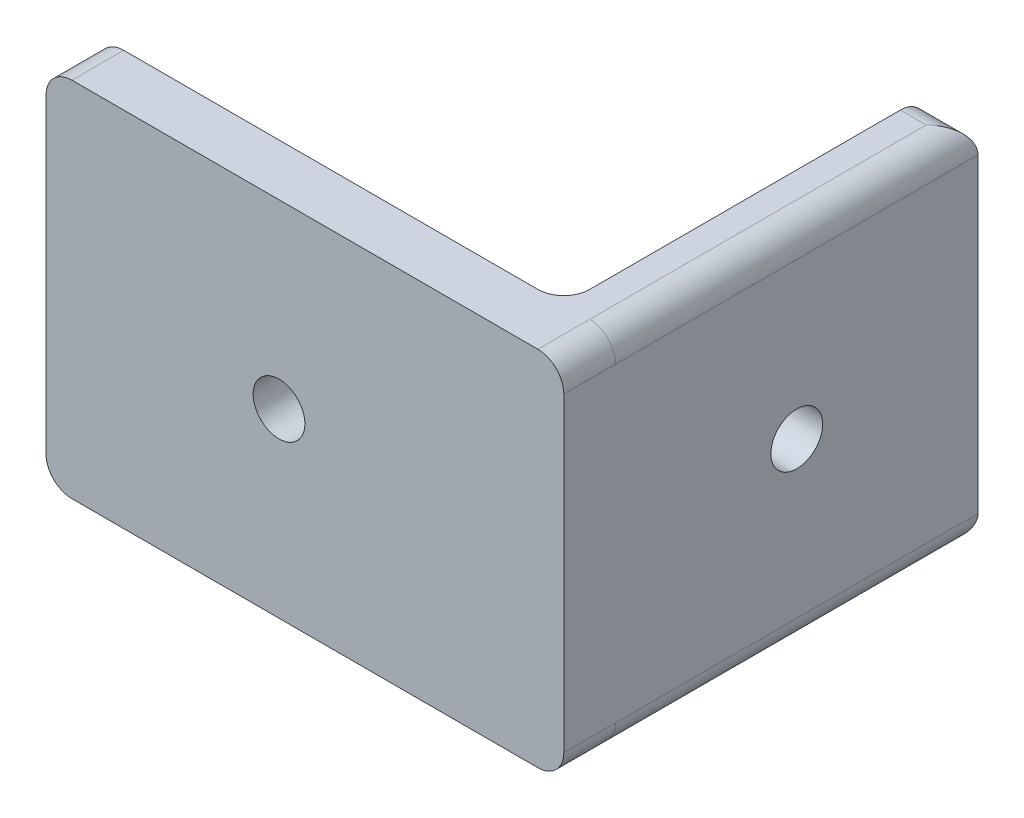
ISO-10303-21;
HEADER;
FILE_DESCRIPTION(('STEP AP214'),'2;1');
FILE_NAME('part.step','',(''),(''),'','','');
FILE_SCHEMA(('AUTOMOTIVE_DESIGN { 1 0 10303 214 1 1 1 1 }'));
ENDSEC;
DATA;
#1=APPLICATION_CONTEXT('core data for automotive mechanical design processes');
#2=APPLICATION_PROTOCOL_DEFINITION('international standard','automotive_design',2000,#1);
#3=PRODUCT_CONTEXT('',#1,'mechanical');
#4=PRODUCT('Part','Part','',(#3));
#5=PRODUCT_RELATED_PRODUCT_CATEGORY('part','',(#4));
#6=PRODUCT_DEFINITION_FORMATION('','',#4);
#7=PRODUCT_DEFINITION_CONTEXT('part definition',#1,'design');
#8=PRODUCT_DEFINITION('design','',#6,#7);
#9=PRODUCT_DEFINITION_SHAPE('','',#8);
#10=(LENGTH_UNIT() NAMED_UNIT(*) SI_UNIT(.MILLI.,.METRE.));
#11=(NAMED_UNIT(*) PLANE_ANGLE_UNIT() SI_UNIT($,.RADIAN.));
#12=(NAMED_UNIT(*) SI_UNIT($,.STERADIAN.) SOLID_ANGLE_UNIT());
#13=UNCERTAINTY_MEASURE_WITH_UNIT(LENGTH_MEASURE(1.E-05),#10,'distance_accuracy_value','');
#14=(GEOMETRIC_REPRESENTATION_CONTEXT(3) GLOBAL_UNCERTAINTY_ASSIGNED_CONTEXT((#13)) GLOBAL_UNIT_ASSIGNED_CONTEXT((#10,
#11,#12)) REPRESENTATION_CONTEXT('',''));
#15=CARTESIAN_POINT('',(0.,0.,0.));
#16=DIRECTION('',(0.,0.,1.));
#17=DIRECTION('',(1.,0.,0.));
#18=AXIS2_PLACEMENT_3D('',#15,#16,#17);
#19=CARTESIAN_POINT('',(190.,10.,-20.));
#20=DIRECTION('',(0.,0.,1.));
#21=DIRECTION('',(1.,0.,0.));
#22=AXIS2_PLACEMENT_3D('',#19,#20,#21);
#23=PLANE('',#22);
#24=CARTESIAN_POINT('',(90.,70.,-20.));
#25=DIRECTION('',(0.,0.,-1.));
#26=DIRECTION('',(-1.,0.,0.));
#27=AXIS2_PLACEMENT_3D('',#24,#25,#26);
#28=CIRCLE('',#27,9.99999999999999);
#29=CARTESIAN_POINT('',(80.,70.,-20.));
#30=VERTEX_POINT('',#29);
#31=EDGE_CURVE('E180',#30,#30,#28,.T.);
#32=ORIENTED_EDGE('',*,*,#31,.F.);
#33=EDGE_LOOP('',(#32));
#34=FACE_BOUND('',#33,.T.);
#35=DIRECTION('',(-1.,0.,0.));
#36=VECTOR('',#35,1.);
#37=CARTESIAN_POINT('',(10.0000000000001,140.,-20.));
#38=LINE('',#37,#36);
#39=CARTESIAN_POINT('',(170.,140.,-20.));
#40=VERTEX_POINT('',#39);
#41=CARTESIAN_POINT('',(10.0000000000001,140.,-20.));
#42=VERTEX_POINT('',#41);
#43=EDGE_CURVE('E200',#40,#42,#38,.T.);
#44=ORIENTED_EDGE('',*,*,#43,.F.);
#45=DIRECTION('',(0.,1.,0.));
#46=VECTOR('',#45,1.);
#47=CARTESIAN_POINT('',(170.,0.,-20.));
#48=LINE('',#47,#46);
#49=CARTESIAN_POINT('',(170.,0.,-20.));
#50=VERTEX_POINT('',#49);
#51=EDGE_CURVE('E165',#40,#50,#48,.F.);
#52=ORIENTED_EDGE('',*,*,#51,.T.);
#53=DIRECTION('',(1.,0.,0.));
#54=VECTOR('',#53,1.);
#55=CARTESIAN_POINT('',(10.0000000000001,0.,-20.));
#56=LINE('',#55,#54);
#57=CARTESIAN_POINT('',(10.0000000000001,0.,-20.));
#58=VERTEX_POINT('',#57);
#59=EDGE_CURVE('E145',#58,#50,#56,.T.);
#60=ORIENTED_EDGE('',*,*,#59,.F.);
#61=CARTESIAN_POINT('',(10.,10.,-20.));
#62=DIRECTION('',(0.,0.,1.));
#63=DIRECTION('',(-1.,0.,0.));
#64=AXIS2_PLACEMENT_3D('',#61,#62,#63);
#65=CIRCLE('',#64,10.);
#66=CARTESIAN_POINT('',(0.,10.0000000000001,-20.));
#67=VERTEX_POINT('',#66);
#68=EDGE_CURVE('E208',#67,#58,#65,.T.);
#69=ORIENTED_EDGE('',*,*,#68,.F.);
#70=DIRECTION('',(0.,-1.,0.));
#71=VECTOR('',#70,1.);
#72=CARTESIAN_POINT('',(0.,10.0000000000001,-20.));
#73=LINE('',#72,#71);
#74=CARTESIAN_POINT('',(0.,130.,-20.));
#75=VERTEX_POINT('',#74);
#76=EDGE_CURVE('E205',#75,#67,#73,.T.);
#77=ORIENTED_EDGE('',*,*,#76,.F.);
#78=CARTESIAN_POINT('',(10.,130.,-20.));
#79=DIRECTION('',(0.,0.,1.));
#80=DIRECTION('',(-1.,0.,0.));
#81=AXIS2_PLACEMENT_3D('',#78,#79,#80);
#82=CIRCLE('',#81,10.);
#83=EDGE_CURVE('E202',#42,#75,#82,.T.);
#84=ORIENTED_EDGE('',*,*,#83,.F.);
#85=EDGE_LOOP('',(#44,#52,#60,#69,#77,#84));
#86=FACE_BOUND('',#85,.T.);
#87=ADVANCED_FACE('F33',(#34,#86),#23,.F.);
#88=CARTESIAN_POINT('',(190.,10.,-20.));
#89=DIRECTION('',(0.,0.,1.));
#90=DIRECTION('',(1.,0.,0.));
#91=AXIS2_PLACEMENT_3D('',#88,#89,#90);
#92=CYLINDRICAL_SURFACE('',#91,10.);
#93=CARTESIAN_POINT('',(190.,10.,0.));
#94=DIRECTION('',(0.,0.,1.));
#95=DIRECTION('',(1.,0.,0.));
#96=AXIS2_PLACEMENT_3D('',#93,#94,#95);
#97=CIRCLE('',#96,10.);
#98=CARTESIAN_POINT('',(190.,0.,0.));
#99=VERTEX_POINT('',#98);
#100=CARTESIAN_POINT('',(200.,10.0000000000001,0.));
#101=VERTEX_POINT('',#100);
#102=EDGE_CURVE('E196',#99,#101,#97,.T.);
#103=ORIENTED_EDGE('',*,*,#102,.F.);
#104=DIRECTION('',(0.,0.,1.));
#105=VECTOR('',#104,1.);
#106=CARTESIAN_POINT('',(190.,0.,-20.));
#107=LINE('',#106,#105);
#108=CARTESIAN_POINT('',(190.,0.,-20.));
#109=VERTEX_POINT('',#108);
#110=EDGE_CURVE('E151',#109,#99,#107,.T.);
#111=ORIENTED_EDGE('',*,*,#110,.F.);
#112=CARTESIAN_POINT('',(190.,10.,-20.));
#113=DIRECTION('',(0.,0.,1.));
#114=DIRECTION('',(1.,0.,0.));
#115=AXIS2_PLACEMENT_3D('',#112,#113,#114);
#116=CIRCLE('',#115,10.);
#117=CARTESIAN_POINT('',(200.,10.0000000000001,-20.));
#118=VERTEX_POINT('',#117);
#119=EDGE_CURVE('E149',#109,#118,#116,.T.);
#120=ORIENTED_EDGE('',*,*,#119,.T.);
#121=DIRECTION('',(0.,0.,1.));
#122=VECTOR('',#121,1.);
#123=CARTESIAN_POINT('',(200.,10.0000000000001,-20.));
#124=LINE('',#123,#122);
#125=EDGE_CURVE('E132',#118,#101,#124,.T.);
#126=ORIENTED_EDGE('',*,*,#125,.T.);
#127=EDGE_LOOP('',(#103,#111,#120,#126));
#128=FACE_BOUND('',#127,.T.);
#129=ADVANCED_FACE('F150',(#128),#92,.T.);
#130=CARTESIAN_POINT('',(10.0000000000001,0.,-20.));
#131=DIRECTION('',(0.,-1.,0.));
#132=DIRECTION('',(0.,0.,-1.));
#133=AXIS2_PLACEMENT_3D('',#130,#131,#132);
#134=PLANE('',#133);
#135=DIRECTION('',(0.,0.,1.));
#136=VECTOR('',#135,1.);
#137=CARTESIAN_POINT('',(180.,0.,-160.));
#138=LINE('',#137,#136);
#139=CARTESIAN_POINT('',(180.,0.,-150.));
#140=VERTEX_POINT('',#139);
#141=CARTESIAN_POINT('',(180.,0.,-30.));
#142=VERTEX_POINT('',#141);
#143=EDGE_CURVE('E192',#140,#142,#138,.T.);
#144=ORIENTED_EDGE('',*,*,#143,.F.);
#145=DIRECTION('',(-1.,0.,0.));
#146=VECTOR('',#145,1.);
#147=CARTESIAN_POINT('',(200.,0.,-150.));
#148=LINE('',#147,#146);
#149=CARTESIAN_POINT('',(190.,0.,-150.));
#150=VERTEX_POINT('',#149);
#151=EDGE_CURVE('E259',#140,#150,#148,.F.);
#152=ORIENTED_EDGE('',*,*,#151,.T.);
#153=DIRECTION('',(0.,0.,1.));
#154=VECTOR('',#153,1.);
#155=CARTESIAN_POINT('',(190.,0.,-20.));
#156=LINE('',#155,#154);
#157=EDGE_CURVE('E257',#150,#109,#156,.T.);
#158=ORIENTED_EDGE('',*,*,#157,.T.);
#159=ORIENTED_EDGE('',*,*,#110,.T.);
#160=DIRECTION('',(1.,0.,0.));
#161=VECTOR('',#160,1.);
#162=CARTESIAN_POINT('',(10.0000000000001,0.,0.));
#163=LINE('',#162,#161);
#164=CARTESIAN_POINT('',(10.0000000000001,0.,0.));
#165=VERTEX_POINT('',#164);
#166=EDGE_CURVE('E155',#165,#99,#163,.T.);
#167=ORIENTED_EDGE('',*,*,#166,.F.);
#168=DIRECTION('',(0.,0.,1.));
#169=VECTOR('',#168,1.);
#170=CARTESIAN_POINT('',(10.0000000000001,0.,-20.));
#171=LINE('',#170,#169);
#172=EDGE_CURVE('E234',#58,#165,#171,.T.);
#173=ORIENTED_EDGE('',*,*,#172,.F.);
#174=ORIENTED_EDGE('',*,*,#59,.T.);
#175=CARTESIAN_POINT('',(170.,0.,-30.));
#176=DIRECTION('',(0.,-1.,0.));
#177=DIRECTION('',(0.,0.,-1.));
#178=AXIS2_PLACEMENT_3D('',#175,#176,#177);
#179=CIRCLE('',#178,10.);
#180=EDGE_CURVE('E11',#50,#142,#179,.F.);
#181=ORIENTED_EDGE('',*,*,#180,.T.);
#182=EDGE_LOOP('',(#144,#152,#158,#159,#167,#173,#174,#181));
#183=FACE_BOUND('',#182,.T.);
#184=ADVANCED_FACE('F272',(#183),#134,.T.);
#185=CARTESIAN_POINT('',(10.,10.,-20.));
#186=DIRECTION('',(0.,0.,1.));
#187=DIRECTION('',(1.,0.,0.));
#188=AXIS2_PLACEMENT_3D('',#185,#186,#187);
#189=CYLINDRICAL_SURFACE('',#188,10.);
#190=CARTESIAN_POINT('',(10.,10.,0.));
#191=DIRECTION('',(0.,0.,1.));
#192=DIRECTION('',(-1.,0.,0.));
#193=AXIS2_PLACEMENT_3D('',#190,#191,#192);
#194=CIRCLE('',#193,10.);
#195=CARTESIAN_POINT('',(0.,10.0000000000001,0.));
#196=VERTEX_POINT('',#195);
#197=EDGE_CURVE('E227',#196,#165,#194,.T.);
#198=ORIENTED_EDGE('',*,*,#197,.F.);
#199=DIRECTION('',(0.,0.,1.));
#200=VECTOR('',#199,1.);
#201=CARTESIAN_POINT('',(0.,10.0000000000001,-20.));
#202=LINE('',#201,#200);
#203=EDGE_CURVE('E236',#67,#196,#202,.T.);
#204=ORIENTED_EDGE('',*,*,#203,.F.);
#205=ORIENTED_EDGE('',*,*,#68,.T.);
#206=ORIENTED_EDGE('',*,*,#172,.T.);
#207=EDGE_LOOP('',(#198,#204,#205,#206));
#208=FACE_BOUND('',#207,.T.);
#209=ADVANCED_FACE('F312',(#208),#189,.T.);
#210=CARTESIAN_POINT('',(0.,10.0000000000001,-20.));
#211=DIRECTION('',(-1.,0.,0.));
#212=DIRECTION('',(0.,0.,1.));
#213=AXIS2_PLACEMENT_3D('',#210,#211,#212);
#214=PLANE('',#213);
#215=DIRECTION('',(0.,-1.,0.));
#216=VECTOR('',#215,1.);
#217=CARTESIAN_POINT('',(0.,10.0000000000001,0.));
#218=LINE('',#217,#216);
#219=CARTESIAN_POINT('',(0.,130.,0.));
#220=VERTEX_POINT('',#219);
#221=EDGE_CURVE('E224',#220,#196,#218,.T.);
#222=ORIENTED_EDGE('',*,*,#221,.F.);
#223=DIRECTION('',(0.,0.,1.));
#224=VECTOR('',#223,1.);
#225=CARTESIAN_POINT('',(0.,130.,-20.));
#226=LINE('',#225,#224);
#227=EDGE_CURVE('E238',#75,#220,#226,.T.);
#228=ORIENTED_EDGE('',*,*,#227,.F.);
#229=ORIENTED_EDGE('',*,*,#76,.T.);
#230=ORIENTED_EDGE('',*,*,#203,.T.);
#231=EDGE_LOOP('',(#222,#228,#229,#230));
#232=FACE_BOUND('',#231,.T.);
#233=ADVANCED_FACE('F315',(#232),#214,.T.);
#234=CARTESIAN_POINT('',(10.,130.,-20.));
#235=DIRECTION('',(0.,0.,1.));
#236=DIRECTION('',(1.,0.,0.));
#237=AXIS2_PLACEMENT_3D('',#234,#235,#236);
#238=CYLINDRICAL_SURFACE('',#237,10.);
#239=CARTESIAN_POINT('',(10.,130.,0.));
#240=DIRECTION('',(0.,0.,1.));
#241=DIRECTION('',(-1.,0.,0.));
#242=AXIS2_PLACEMENT_3D('',#239,#240,#241);
#243=CIRCLE('',#242,10.);
#244=CARTESIAN_POINT('',(10.0000000000001,140.,0.));
#245=VERTEX_POINT('',#244);
#246=EDGE_CURVE('E221',#245,#220,#243,.T.);
#247=ORIENTED_EDGE('',*,*,#246,.F.);
#248=DIRECTION('',(0.,0.,1.));
#249=VECTOR('',#248,1.);
#250=CARTESIAN_POINT('',(10.0000000000001,140.,-20.));
#251=LINE('',#250,#249);
#252=EDGE_CURVE('E240',#42,#245,#251,.T.);
#253=ORIENTED_EDGE('',*,*,#252,.F.);
#254=ORIENTED_EDGE('',*,*,#83,.T.);
#255=ORIENTED_EDGE('',*,*,#227,.T.);
#256=EDGE_LOOP('',(#247,#253,#254,#255));
#257=FACE_BOUND('',#256,.T.);
#258=ADVANCED_FACE('F319',(#257),#238,.T.);
#259=CARTESIAN_POINT('',(10.0000000000001,140.,-20.));
#260=DIRECTION('',(0.,1.,0.));
#261=DIRECTION('',(0.,0.,1.));
#262=AXIS2_PLACEMENT_3D('',#259,#260,#261);
#263=PLANE('',#262);
#264=DIRECTION('',(0.,0.,1.));
#265=VECTOR('',#264,1.);
#266=CARTESIAN_POINT('',(190.,140.,-20.));
#267=LINE('',#266,#265);
#268=CARTESIAN_POINT('',(190.,140.,-20.));
#269=VERTEX_POINT('',#268);
#270=CARTESIAN_POINT('',(190.,140.,-150.));
#271=VERTEX_POINT('',#270);
#272=EDGE_CURVE('E50',#269,#271,#267,.F.);
#273=ORIENTED_EDGE('',*,*,#272,.T.);
#274=DIRECTION('',(1.,0.,0.));
#275=VECTOR('',#274,1.);
#276=CARTESIAN_POINT('',(180.,140.,-150.));
#277=LINE('',#276,#275);
#278=CARTESIAN_POINT('',(180.,140.,-150.));
#279=VERTEX_POINT('',#278);
#280=EDGE_CURVE('E262',#271,#279,#277,.F.);
#281=ORIENTED_EDGE('',*,*,#280,.T.);
#282=DIRECTION('',(0.,0.,1.));
#283=VECTOR('',#282,1.);
#284=CARTESIAN_POINT('',(180.,140.,-160.));
#285=LINE('',#284,#283);
#286=CARTESIAN_POINT('',(180.,140.,-30.));
#287=VERTEX_POINT('',#286);
#288=EDGE_CURVE('E195',#279,#287,#285,.T.);
#289=ORIENTED_EDGE('',*,*,#288,.T.);
#290=CARTESIAN_POINT('',(170.,140.,-30.));
#291=DIRECTION('',(0.,1.,0.));
#292=DIRECTION('',(0.,0.,1.));
#293=AXIS2_PLACEMENT_3D('',#290,#291,#292);
#294=CIRCLE('',#293,10.);
#295=EDGE_CURVE('E42',#287,#40,#294,.F.);
#296=ORIENTED_EDGE('',*,*,#295,.T.);
#297=ORIENTED_EDGE('',*,*,#43,.T.);
#298=ORIENTED_EDGE('',*,*,#252,.T.);
#299=DIRECTION('',(-1.,0.,0.));
#300=VECTOR('',#299,1.);
#301=CARTESIAN_POINT('',(10.0000000000001,140.,0.));
#302=LINE('',#301,#300);
#303=CARTESIAN_POINT('',(190.,140.,0.));
#304=VERTEX_POINT('',#303);
#305=EDGE_CURVE('E218',#304,#245,#302,.T.);
#306=ORIENTED_EDGE('',*,*,#305,.F.);
#307=DIRECTION('',(0.,0.,1.));
#308=VECTOR('',#307,1.);
#309=CARTESIAN_POINT('',(190.,140.,-20.));
#310=LINE('',#309,#308);
#311=EDGE_CURVE('E242',#269,#304,#310,.T.);
#312=ORIENTED_EDGE('',*,*,#311,.F.);
#313=EDGE_LOOP('',(#273,#281,#289,#296,#297,#298,#306,#312));
#314=FACE_BOUND('',#313,.T.);
#315=ADVANCED_FACE('F280',(#314),#263,.T.);
#316=CARTESIAN_POINT('',(190.,130.,-20.));
#317=DIRECTION('',(0.,0.,1.));
#318=DIRECTION('',(1.,0.,0.));
#319=AXIS2_PLACEMENT_3D('',#316,#317,#318);
#320=CYLINDRICAL_SURFACE('',#319,10.);
#321=CARTESIAN_POINT('',(190.,130.,0.));
#322=DIRECTION('',(0.,0.,1.));
#323=DIRECTION('',(-1.,0.,0.));
#324=AXIS2_PLACEMENT_3D('',#321,#322,#323);
#325=CIRCLE('',#324,10.);
#326=CARTESIAN_POINT('',(200.,130.,0.));
#327=VERTEX_POINT('',#326);
#328=EDGE_CURVE('E215',#327,#304,#325,.T.);
#329=ORIENTED_EDGE('',*,*,#328,.F.);
#330=DIRECTION('',(0.,0.,1.));
#331=VECTOR('',#330,1.);
#332=CARTESIAN_POINT('',(200.,130.,-20.));
#333=LINE('',#332,#331);
#334=CARTESIAN_POINT('',(200.,130.,-20.));
#335=VERTEX_POINT('',#334);
#336=EDGE_CURVE('E144',#335,#327,#333,.T.);
#337=ORIENTED_EDGE('',*,*,#336,.F.);
#338=CARTESIAN_POINT('',(190.,130.,-20.));
#339=DIRECTION('',(0.,0.,1.));
#340=DIRECTION('',(-1.,0.,0.));
#341=AXIS2_PLACEMENT_3D('',#338,#339,#340);
#342=CIRCLE('',#341,10.);
#343=EDGE_CURVE('E154',#335,#269,#342,.T.);
#344=ORIENTED_EDGE('',*,*,#343,.T.);
#345=ORIENTED_EDGE('',*,*,#311,.T.);
#346=EDGE_LOOP('',(#329,#337,#344,#345));
#347=FACE_BOUND('',#346,.T.);
#348=ADVANCED_FACE('F326',(#347),#320,.T.);
#349=CARTESIAN_POINT('',(200.,10.0000000000001,-20.));
#350=DIRECTION('',(1.,0.,0.));
#351=DIRECTION('',(0.,0.,-1.));
#352=AXIS2_PLACEMENT_3D('',#349,#350,#351);
#353=PLANE('',#352);
#354=CARTESIAN_POINT('',(200.,70.,-90.));
#355=DIRECTION('',(-1.,0.,0.));
#356=DIRECTION('',(0.,-1.,0.));
#357=AXIS2_PLACEMENT_3D('',#354,#355,#356);
#358=CIRCLE('',#357,9.99999999999999);
#359=CARTESIAN_POINT('',(200.,60.,-90.));
#360=VERTEX_POINT('',#359);
#361=EDGE_CURVE('E185',#360,#360,#358,.T.);
#362=ORIENTED_EDGE('',*,*,#361,.T.);
#363=EDGE_LOOP('',(#362));
#364=FACE_BOUND('',#363,.T.);
#365=ORIENTED_EDGE('',*,*,#125,.F.);
#366=DIRECTION('',(0.,0.,1.));
#367=VECTOR('',#366,1.);
#368=CARTESIAN_POINT('',(200.,10.,-20.));
#369=LINE('',#368,#367);
#370=CARTESIAN_POINT('',(200.,10.,-160.));
#371=VERTEX_POINT('',#370);
#372=EDGE_CURVE('E137',#118,#371,#369,.F.);
#373=ORIENTED_EDGE('',*,*,#372,.T.);
#374=DIRECTION('',(0.,-1.,0.));
#375=VECTOR('',#374,1.);
#376=CARTESIAN_POINT('',(200.,140.,-160.));
#377=LINE('',#376,#375);
#378=CARTESIAN_POINT('',(200.,130.,-160.));
#379=VERTEX_POINT('',#378);
#380=EDGE_CURVE('E172',#379,#371,#377,.T.);
#381=ORIENTED_EDGE('',*,*,#380,.F.);
#382=DIRECTION('',(0.,0.,1.));
#383=VECTOR('',#382,1.);
#384=CARTESIAN_POINT('',(200.,130.,-20.));
#385=LINE('',#384,#383);
#386=EDGE_CURVE('E162',#379,#335,#385,.T.);
#387=ORIENTED_EDGE('',*,*,#386,.T.);
#388=ORIENTED_EDGE('',*,*,#336,.T.);
#389=DIRECTION('',(0.,1.,0.));
#390=VECTOR('',#389,1.);
#391=CARTESIAN_POINT('',(200.,10.0000000000001,0.));
#392=LINE('',#391,#390);
#393=EDGE_CURVE('E140',#101,#327,#392,.T.);
#394=ORIENTED_EDGE('',*,*,#393,.F.);
#395=EDGE_LOOP('',(#365,#373,#381,#387,#388,#394));
#396=FACE_BOUND('',#395,.T.);
#397=ADVANCED_FACE('F134',(#364,#396),#353,.T.);
#398=CARTESIAN_POINT('',(190.,10.,0.));
#399=DIRECTION('',(0.,0.,1.));
#400=DIRECTION('',(1.,0.,0.));
#401=AXIS2_PLACEMENT_3D('',#398,#399,#400);
#402=PLANE('',#401);
#403=CARTESIAN_POINT('',(90.,70.,0.));
#404=DIRECTION('',(0.,0.,-1.));
#405=DIRECTION('',(-1.,0.,0.));
#406=AXIS2_PLACEMENT_3D('',#403,#404,#405);
#407=CIRCLE('',#406,9.99999999999999);
#408=CARTESIAN_POINT('',(80.,70.,0.));
#409=VERTEX_POINT('',#408);
#410=EDGE_CURVE('E174',#409,#409,#407,.T.);
#411=ORIENTED_EDGE('',*,*,#410,.T.);
#412=EDGE_LOOP('',(#411));
#413=FACE_BOUND('',#412,.T.);
#414=ORIENTED_EDGE('',*,*,#102,.T.);
#415=ORIENTED_EDGE('',*,*,#393,.T.);
#416=ORIENTED_EDGE('',*,*,#328,.T.);
#417=ORIENTED_EDGE('',*,*,#305,.T.);
#418=ORIENTED_EDGE('',*,*,#246,.T.);
#419=ORIENTED_EDGE('',*,*,#221,.T.);
#420=ORIENTED_EDGE('',*,*,#197,.T.);
#421=ORIENTED_EDGE('',*,*,#166,.T.);
#422=EDGE_LOOP('',(#414,#415,#416,#417,#418,#419,#420,#421));
#423=FACE_BOUND('',#422,.T.);
#424=ADVANCED_FACE('F307',(#413,#423),#402,.T.);
#425=CARTESIAN_POINT('',(180.,140.,-160.));
#426=DIRECTION('',(1.,0.,0.));
#427=DIRECTION('',(0.,1.,0.));
#428=AXIS2_PLACEMENT_3D('',#425,#426,#427);
#429=PLANE('',#428);
#430=CARTESIAN_POINT('',(180.,70.,-90.));
#431=DIRECTION('',(-1.,0.,0.));
#432=DIRECTION('',(0.,-1.,0.));
#433=AXIS2_PLACEMENT_3D('',#430,#431,#432);
#434=CIRCLE('',#433,9.99999999999999);
#435=CARTESIAN_POINT('',(180.,60.,-90.));
#436=VERTEX_POINT('',#435);
#437=EDGE_CURVE('E188',#436,#436,#434,.T.);
#438=ORIENTED_EDGE('',*,*,#437,.F.);
#439=EDGE_LOOP('',(#438));
#440=FACE_BOUND('',#439,.T.);
#441=DIRECTION('',(0.,1.,0.));
#442=VECTOR('',#441,1.);
#443=CARTESIAN_POINT('',(180.,140.,-160.));
#444=LINE('',#443,#442);
#445=CARTESIAN_POINT('',(180.,10.,-160.));
#446=VERTEX_POINT('',#445);
#447=CARTESIAN_POINT('',(180.,130.,-160.));
#448=VERTEX_POINT('',#447);
#449=EDGE_CURVE('E168',#446,#448,#444,.T.);
#450=ORIENTED_EDGE('',*,*,#449,.F.);
#451=CARTESIAN_POINT('',(180.,10.,-150.));
#452=DIRECTION('',(1.,0.,0.));
#453=DIRECTION('',(0.,1.,0.));
#454=AXIS2_PLACEMENT_3D('',#451,#452,#453);
#455=CIRCLE('',#454,10.);
#456=EDGE_CURVE('E255',#446,#140,#455,.F.);
#457=ORIENTED_EDGE('',*,*,#456,.T.);
#458=ORIENTED_EDGE('',*,*,#143,.T.);
#459=DIRECTION('',(0.,1.,0.));
#460=VECTOR('',#459,1.);
#461=CARTESIAN_POINT('',(180.,140.,-30.));
#462=LINE('',#461,#460);
#463=EDGE_CURVE('E250',#142,#287,#462,.T.);
#464=ORIENTED_EDGE('',*,*,#463,.T.);
#465=ORIENTED_EDGE('',*,*,#288,.F.);
#466=CARTESIAN_POINT('',(180.,130.,-150.));
#467=DIRECTION('',(1.,0.,0.));
#468=DIRECTION('',(0.,1.,0.));
#469=AXIS2_PLACEMENT_3D('',#466,#467,#468);
#470=CIRCLE('',#469,10.);
#471=EDGE_CURVE('E253',#279,#448,#470,.F.);
#472=ORIENTED_EDGE('',*,*,#471,.T.);
#473=EDGE_LOOP('',(#450,#457,#458,#464,#465,#472));
#474=FACE_BOUND('',#473,.T.);
#475=ADVANCED_FACE('F278',(#440,#474),#429,.F.);
#476=CARTESIAN_POINT('',(0.,0.,-160.));
#477=DIRECTION('',(0.,0.,1.));
#478=DIRECTION('',(1.,0.,0.));
#479=AXIS2_PLACEMENT_3D('',#476,#477,#478);
#480=PLANE('',#479);
#481=ORIENTED_EDGE('',*,*,#380,.T.);
#482=DIRECTION('',(-1.,0.,0.));
#483=VECTOR('',#482,1.);
#484=CARTESIAN_POINT('',(180.,10.,-160.));
#485=LINE('',#484,#483);
#486=EDGE_CURVE('E247',#371,#446,#485,.T.);
#487=ORIENTED_EDGE('',*,*,#486,.T.);
#488=ORIENTED_EDGE('',*,*,#449,.T.);
#489=DIRECTION('',(1.,0.,0.));
#490=VECTOR('',#489,1.);
#491=CARTESIAN_POINT('',(200.,130.,-160.));
#492=LINE('',#491,#490);
#493=EDGE_CURVE('E233',#448,#379,#492,.T.);
#494=ORIENTED_EDGE('',*,*,#493,.T.);
#495=EDGE_LOOP('',(#481,#487,#488,#494));
#496=FACE_BOUND('',#495,.T.);
#497=ADVANCED_FACE('F287',(#496),#480,.F.);
#498=CARTESIAN_POINT('',(190.,10.,-20.));
#499=DIRECTION('',(0.,0.,1.));
#500=DIRECTION('',(1.,0.,0.));
#501=AXIS2_PLACEMENT_3D('',#498,#499,#500);
#502=CYLINDRICAL_SURFACE('',#501,10.);
#503=ORIENTED_EDGE('',*,*,#119,.F.);
#504=ORIENTED_EDGE('',*,*,#157,.F.);
#505=CARTESIAN_POINT('',(190.,10.,-150.));
#506=DIRECTION('',(0.707106781186547,0.,0.707106781186547));
#507=DIRECTION('',(-0.707106781186547,0.,0.707106781186547));
#508=AXIS2_PLACEMENT_3D('',#505,#506,#507);
#509=ELLIPSE('',#508,14.1421356237309,10.);
#510=EDGE_CURVE('E160',#371,#150,#509,.F.);
#511=ORIENTED_EDGE('',*,*,#510,.F.);
#512=ORIENTED_EDGE('',*,*,#372,.F.);
#513=EDGE_LOOP('',(#503,#504,#511,#512));
#514=FACE_BOUND('',#513,.T.);
#515=ADVANCED_FACE('F158',(#514),#502,.T.);
#516=CARTESIAN_POINT('',(0.,10.,-150.));
#517=DIRECTION('',(1.,0.,0.));
#518=DIRECTION('',(0.,0.,-1.));
#519=AXIS2_PLACEMENT_3D('',#516,#517,#518);
#520=CYLINDRICAL_SURFACE('',#519,10.);
#521=ORIENTED_EDGE('',*,*,#510,.T.);
#522=ORIENTED_EDGE('',*,*,#151,.F.);
#523=ORIENTED_EDGE('',*,*,#456,.F.);
#524=ORIENTED_EDGE('',*,*,#486,.F.);
#525=EDGE_LOOP('',(#521,#522,#523,#524));
#526=FACE_BOUND('',#525,.T.);
#527=ADVANCED_FACE('F288',(#526),#520,.T.);
#528=CARTESIAN_POINT('',(190.,130.,-20.));
#529=DIRECTION('',(0.,0.,1.));
#530=DIRECTION('',(1.,0.,0.));
#531=AXIS2_PLACEMENT_3D('',#528,#529,#530);
#532=CYLINDRICAL_SURFACE('',#531,10.);
#533=ORIENTED_EDGE('',*,*,#343,.F.);
#534=ORIENTED_EDGE('',*,*,#386,.F.);
#535=CARTESIAN_POINT('',(190.,130.,-150.));
#536=DIRECTION('',(0.707106781186547,0.,0.707106781186547));
#537=DIRECTION('',(-0.707106781186547,0.,0.707106781186547));
#538=AXIS2_PLACEMENT_3D('',#535,#536,#537);
#539=ELLIPSE('',#538,14.1421356237309,10.);
#540=EDGE_CURVE('E37',#271,#379,#539,.F.);
#541=ORIENTED_EDGE('',*,*,#540,.F.);
#542=ORIENTED_EDGE('',*,*,#272,.F.);
#543=EDGE_LOOP('',(#533,#534,#541,#542));
#544=FACE_BOUND('',#543,.T.);
#545=ADVANCED_FACE('F284',(#544),#532,.T.);
#546=CARTESIAN_POINT('',(0.,130.,-150.));
#547=DIRECTION('',(-1.,0.,0.));
#548=DIRECTION('',(0.,0.,1.));
#549=AXIS2_PLACEMENT_3D('',#546,#547,#548);
#550=CYLINDRICAL_SURFACE('',#549,10.);
#551=ORIENTED_EDGE('',*,*,#471,.F.);
#552=ORIENTED_EDGE('',*,*,#280,.F.);
#553=ORIENTED_EDGE('',*,*,#540,.T.);
#554=ORIENTED_EDGE('',*,*,#493,.F.);
#555=EDGE_LOOP('',(#551,#552,#553,#554));
#556=FACE_BOUND('',#555,.T.);
#557=ADVANCED_FACE('F281',(#556),#550,.T.);
#558=CARTESIAN_POINT('',(170.,140.,-30.));
#559=DIRECTION('',(0.,-1.,0.));
#560=DIRECTION('',(1.,0.,0.));
#561=AXIS2_PLACEMENT_3D('',#558,#559,#560);
#562=CYLINDRICAL_SURFACE('',#561,10.);
#563=ORIENTED_EDGE('',*,*,#180,.F.);
#564=ORIENTED_EDGE('',*,*,#51,.F.);
#565=ORIENTED_EDGE('',*,*,#295,.F.);
#566=ORIENTED_EDGE('',*,*,#463,.F.);
#567=EDGE_LOOP('',(#563,#564,#565,#566));
#568=FACE_BOUND('',#567,.T.);
#569=ADVANCED_FACE('F35',(#568),#562,.F.);
#570=CARTESIAN_POINT('',(90.,70.,0.));
#571=DIRECTION('',(0.,0.,-1.));
#572=DIRECTION('',(-1.,0.,0.));
#573=AXIS2_PLACEMENT_3D('',#570,#571,#572);
#574=CYLINDRICAL_SURFACE('',#573,9.99999999999999);
#575=ORIENTED_EDGE('',*,*,#410,.F.);
#576=EDGE_LOOP('',(#575));
#577=FACE_BOUND('',#576,.T.);
#578=ORIENTED_EDGE('',*,*,#31,.T.);
#579=EDGE_LOOP('',(#578));
#580=FACE_BOUND('',#579,.T.);
#581=ADVANCED_FACE('F349',(#577,#580),#574,.F.);
#582=CARTESIAN_POINT('',(200.,70.,-90.));
#583=DIRECTION('',(-1.,0.,0.));
#584=DIRECTION('',(0.,-1.,0.));
#585=AXIS2_PLACEMENT_3D('',#582,#583,#584);
#586=CYLINDRICAL_SURFACE('',#585,9.99999999999999);
#587=ORIENTED_EDGE('',*,*,#361,.F.);
#588=EDGE_LOOP('',(#587));
#589=FACE_BOUND('',#588,.T.);
#590=ORIENTED_EDGE('',*,*,#437,.T.);
#591=EDGE_LOOP('',(#590));
#592=FACE_BOUND('',#591,.T.);
#593=ADVANCED_FACE('F340',(#589,#592),#586,.F.);
#594=CLOSED_SHELL('',(#87,#129,#184,#209,#233,#258,#315,#348,#397,#424,#475,#497,#515,#527,#545,
#557,#569,#581,#593));
#595=MANIFOLD_SOLID_BREP('B2',#594);
#596=ADVANCED_BREP_SHAPE_REPRESENTATION('',(#18,#595),#14);
#597=SHAPE_DEFINITION_REPRESENTATION(#9,#596);
ENDSEC;
END-ISO-10303-21;
